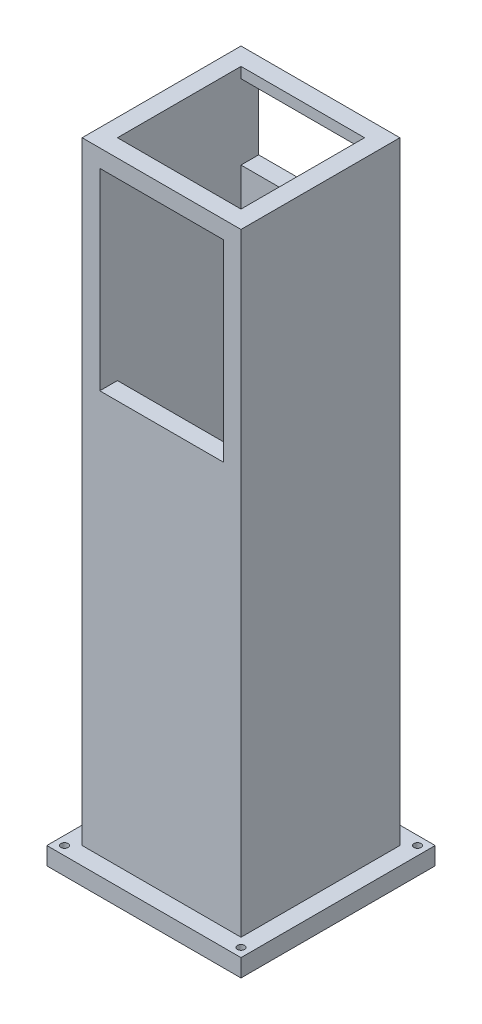
ISO-10303-21;
HEADER;
FILE_DESCRIPTION(('STEP AP214'),'2;1');
FILE_NAME('part.step','',(''),(''),'','','');
FILE_SCHEMA(('AUTOMOTIVE_DESIGN { 1 0 10303 214 1 1 1 1 }'));
ENDSEC;
DATA;
#1=APPLICATION_CONTEXT('core data for automotive mechanical design processes');
#2=APPLICATION_PROTOCOL_DEFINITION('international standard','automotive_design',2000,#1);
#3=PRODUCT_CONTEXT('',#1,'mechanical');
#4=PRODUCT('Part','Part','',(#3));
#5=PRODUCT_RELATED_PRODUCT_CATEGORY('part','',(#4));
#6=PRODUCT_DEFINITION_FORMATION('','',#4);
#7=PRODUCT_DEFINITION_CONTEXT('part definition',#1,'design');
#8=PRODUCT_DEFINITION('design','',#6,#7);
#9=PRODUCT_DEFINITION_SHAPE('','',#8);
#10=(LENGTH_UNIT() NAMED_UNIT(*) SI_UNIT(.MILLI.,.METRE.));
#11=(NAMED_UNIT(*) PLANE_ANGLE_UNIT() SI_UNIT($,.RADIAN.));
#12=(NAMED_UNIT(*) SI_UNIT($,.STERADIAN.) SOLID_ANGLE_UNIT());
#13=UNCERTAINTY_MEASURE_WITH_UNIT(LENGTH_MEASURE(1.E-05),#10,'distance_accuracy_value','');
#14=(GEOMETRIC_REPRESENTATION_CONTEXT(3) GLOBAL_UNCERTAINTY_ASSIGNED_CONTEXT((#13)) GLOBAL_UNIT_ASSIGNED_CONTEXT((#10,
#11,#12)) REPRESENTATION_CONTEXT('',''));
#15=CARTESIAN_POINT('',(0.,0.,0.));
#16=DIRECTION('',(0.,0.,1.));
#17=DIRECTION('',(1.,0.,0.));
#18=AXIS2_PLACEMENT_3D('',#15,#16,#17);
#19=CARTESIAN_POINT('',(-17.5,0.,17.5));
#20=DIRECTION('',(0.,0.,1.));
#21=DIRECTION('',(1.,0.,0.));
#22=AXIS2_PLACEMENT_3D('',#19,#20,#21);
#23=PLANE('',#22);
#24=DIRECTION('',(0.,1.,0.));
#25=VECTOR('',#24,1.);
#26=CARTESIAN_POINT('',(-17.5,0.,17.5));
#27=LINE('',#26,#25);
#28=CARTESIAN_POINT('',(-17.5,268.612120728358,17.5));
#29=VERTEX_POINT('',#28);
#30=CARTESIAN_POINT('',(-17.5,273.612120728358,17.5));
#31=VERTEX_POINT('',#30);
#32=EDGE_CURVE('E332',#29,#31,#27,.T.);
#33=ORIENTED_EDGE('',*,*,#32,.T.);
#34=DIRECTION('',(1.,0.,0.));
#35=VECTOR('',#34,1.);
#36=CARTESIAN_POINT('',(-17.5,273.612120728358,17.5));
#37=LINE('',#36,#35);
#38=CARTESIAN_POINT('',(17.5,273.612120728358,17.5));
#39=VERTEX_POINT('',#38);
#40=EDGE_CURVE('E278',#31,#39,#37,.T.);
#41=ORIENTED_EDGE('',*,*,#40,.T.);
#42=DIRECTION('',(0.,1.,0.));
#43=VECTOR('',#42,1.);
#44=CARTESIAN_POINT('',(17.5,0.,17.5));
#45=LINE('',#44,#43);
#46=CARTESIAN_POINT('',(17.5,268.612120728358,17.5));
#47=VERTEX_POINT('',#46);
#48=EDGE_CURVE('E345',#47,#39,#45,.T.);
#49=ORIENTED_EDGE('',*,*,#48,.F.);
#50=DIRECTION('',(-1.,0.,0.));
#51=VECTOR('',#50,1.);
#52=CARTESIAN_POINT('',(-17.5,268.612120728358,17.5));
#53=LINE('',#52,#51);
#54=EDGE_CURVE('E384',#47,#29,#53,.T.);
#55=ORIENTED_EDGE('',*,*,#54,.T.);
#56=EDGE_LOOP('',(#33,#41,#49,#55));
#57=FACE_BOUND('',#56,.T.);
#58=ADVANCED_FACE('F43',(#57),#23,.F.);
#59=CARTESIAN_POINT('',(-17.5,0.,-17.5));
#60=DIRECTION('',(0.,0.,1.));
#61=DIRECTION('',(1.,0.,0.));
#62=AXIS2_PLACEMENT_3D('',#59,#60,#61);
#63=PLANE('',#62);
#64=DIRECTION('',(1.,0.,0.));
#65=VECTOR('',#64,1.);
#66=CARTESIAN_POINT('',(-17.5,273.612120728358,-17.5));
#67=LINE('',#66,#65);
#68=CARTESIAN_POINT('',(-17.5,273.612120728358,-17.5));
#69=VERTEX_POINT('',#68);
#70=CARTESIAN_POINT('',(17.5,273.612120728358,-17.5));
#71=VERTEX_POINT('',#70);
#72=EDGE_CURVE('E67',#69,#71,#67,.T.);
#73=ORIENTED_EDGE('',*,*,#72,.F.);
#74=DIRECTION('',(0.,1.,0.));
#75=VECTOR('',#74,1.);
#76=CARTESIAN_POINT('',(-17.5,0.,-17.5));
#77=LINE('',#76,#75);
#78=CARTESIAN_POINT('',(-17.5,270.587205010945,-17.5));
#79=VERTEX_POINT('',#78);
#80=EDGE_CURVE('E353',#79,#69,#77,.T.);
#81=ORIENTED_EDGE('',*,*,#80,.F.);
#82=DIRECTION('',(1.,0.,0.));
#83=VECTOR('',#82,1.);
#84=CARTESIAN_POINT('',(-17.5,270.587205010945,-17.5));
#85=LINE('',#84,#83);
#86=CARTESIAN_POINT('',(17.5,270.587205010945,-17.5));
#87=VERTEX_POINT('',#86);
#88=EDGE_CURVE('E372',#79,#87,#85,.T.);
#89=ORIENTED_EDGE('',*,*,#88,.T.);
#90=DIRECTION('',(0.,1.,0.));
#91=VECTOR('',#90,1.);
#92=CARTESIAN_POINT('',(17.5,0.,-17.5));
#93=LINE('',#92,#91);
#94=EDGE_CURVE('E349',#87,#71,#93,.T.);
#95=ORIENTED_EDGE('',*,*,#94,.T.);
#96=EDGE_LOOP('',(#73,#81,#89,#95));
#97=FACE_BOUND('',#96,.T.);
#98=ADVANCED_FACE('F398',(#97),#63,.T.);
#99=CARTESIAN_POINT('',(22.5,300.,22.5));
#100=DIRECTION('',(-1.,0.,0.));
#101=DIRECTION('',(0.,0.,1.));
#102=AXIS2_PLACEMENT_3D('',#99,#100,#101);
#103=PLANE('',#102);
#104=DIRECTION('',(0.,-1.,0.));
#105=VECTOR('',#104,1.);
#106=CARTESIAN_POINT('',(22.5,300.,22.5));
#107=LINE('',#106,#105);
#108=CARTESIAN_POINT('',(22.5,273.612120728358,22.5));
#109=VERTEX_POINT('',#108);
#110=CARTESIAN_POINT('',(22.5,100.,22.5));
#111=VERTEX_POINT('',#110);
#112=EDGE_CURVE('E357',#109,#111,#107,.T.);
#113=ORIENTED_EDGE('',*,*,#112,.T.);
#114=DIRECTION('',(0.,0.,1.));
#115=VECTOR('',#114,1.);
#116=CARTESIAN_POINT('',(22.5,100.,22.5));
#117=LINE('',#116,#115);
#118=CARTESIAN_POINT('',(22.5,100.,-22.5));
#119=VERTEX_POINT('',#118);
#120=EDGE_CURVE('E232',#119,#111,#117,.T.);
#121=ORIENTED_EDGE('',*,*,#120,.F.);
#122=DIRECTION('',(0.,-1.,0.));
#123=VECTOR('',#122,1.);
#124=CARTESIAN_POINT('',(22.5,300.,-22.5));
#125=LINE('',#124,#123);
#126=CARTESIAN_POINT('',(22.5,273.612120728358,-22.5));
#127=VERTEX_POINT('',#126);
#128=EDGE_CURVE('E368',#127,#119,#125,.T.);
#129=ORIENTED_EDGE('',*,*,#128,.F.);
#130=DIRECTION('',(0.,0.,1.));
#131=VECTOR('',#130,1.);
#132=CARTESIAN_POINT('',(22.5,273.612120728358,-22.5));
#133=LINE('',#132,#131);
#134=EDGE_CURVE('E270',#127,#109,#133,.T.);
#135=ORIENTED_EDGE('',*,*,#134,.T.);
#136=EDGE_LOOP('',(#113,#121,#129,#135));
#137=FACE_BOUND('',#136,.T.);
#138=ADVANCED_FACE('F45',(#137),#103,.F.);
#139=CARTESIAN_POINT('',(-22.5,300.,-22.5));
#140=DIRECTION('',(0.,0.,1.));
#141=DIRECTION('',(1.,0.,0.));
#142=AXIS2_PLACEMENT_3D('',#139,#140,#141);
#143=PLANE('',#142);
#144=DIRECTION('',(0.,1.,0.));
#145=VECTOR('',#144,1.);
#146=CARTESIAN_POINT('',(-17.5,249.412794989055,-22.5));
#147=LINE('',#146,#145);
#148=CARTESIAN_POINT('',(-17.5,249.412794989055,-22.5));
#149=VERTEX_POINT('',#148);
#150=CARTESIAN_POINT('',(-17.5,270.587205010945,-22.5));
#151=VERTEX_POINT('',#150);
#152=EDGE_CURVE('E316',#149,#151,#147,.T.);
#153=ORIENTED_EDGE('',*,*,#152,.F.);
#154=DIRECTION('',(-1.,0.,0.));
#155=VECTOR('',#154,1.);
#156=CARTESIAN_POINT('',(17.5,249.412794989055,-22.5));
#157=LINE('',#156,#155);
#158=CARTESIAN_POINT('',(17.5,249.412794989055,-22.5));
#159=VERTEX_POINT('',#158);
#160=EDGE_CURVE('E304',#159,#149,#157,.T.);
#161=ORIENTED_EDGE('',*,*,#160,.F.);
#162=DIRECTION('',(0.,1.,0.));
#163=VECTOR('',#162,1.);
#164=CARTESIAN_POINT('',(17.5,249.412794989055,-22.5));
#165=LINE('',#164,#163);
#166=CARTESIAN_POINT('',(17.5,270.587205010945,-22.5));
#167=VERTEX_POINT('',#166);
#168=EDGE_CURVE('E324',#159,#167,#165,.T.);
#169=ORIENTED_EDGE('',*,*,#168,.T.);
#170=DIRECTION('',(-1.,0.,0.));
#171=VECTOR('',#170,1.);
#172=CARTESIAN_POINT('',(17.5,270.587205010945,-22.5));
#173=LINE('',#172,#171);
#174=EDGE_CURVE('E320',#167,#151,#173,.T.);
#175=ORIENTED_EDGE('',*,*,#174,.T.);
#176=EDGE_LOOP('',(#153,#161,#169,#175));
#177=FACE_BOUND('',#176,.T.);
#178=ORIENTED_EDGE('',*,*,#128,.T.);
#179=DIRECTION('',(1.,0.,0.));
#180=VECTOR('',#179,1.);
#181=CARTESIAN_POINT('',(-22.5,100.,-22.5));
#182=LINE('',#181,#180);
#183=CARTESIAN_POINT('',(-22.5,100.,-22.5));
#184=VERTEX_POINT('',#183);
#185=EDGE_CURVE('E244',#184,#119,#182,.T.);
#186=ORIENTED_EDGE('',*,*,#185,.F.);
#187=DIRECTION('',(0.,-1.,0.));
#188=VECTOR('',#187,1.);
#189=CARTESIAN_POINT('',(-22.5,300.,-22.5));
#190=LINE('',#189,#188);
#191=CARTESIAN_POINT('',(-22.5,273.612120728358,-22.5));
#192=VERTEX_POINT('',#191);
#193=EDGE_CURVE('E364',#192,#184,#190,.T.);
#194=ORIENTED_EDGE('',*,*,#193,.F.);
#195=DIRECTION('',(1.,0.,0.));
#196=VECTOR('',#195,1.);
#197=CARTESIAN_POINT('',(-22.5,273.612120728358,-22.5));
#198=LINE('',#197,#196);
#199=EDGE_CURVE('E264',#192,#127,#198,.T.);
#200=ORIENTED_EDGE('',*,*,#199,.T.);
#201=EDGE_LOOP('',(#178,#186,#194,#200));
#202=FACE_BOUND('',#201,.T.);
#203=ADVANCED_FACE('F508',(#177,#202),#143,.F.);
#204=CARTESIAN_POINT('',(-22.5,300.,22.5));
#205=DIRECTION('',(1.,0.,0.));
#206=DIRECTION('',(0.,0.,-1.));
#207=AXIS2_PLACEMENT_3D('',#204,#205,#206);
#208=PLANE('',#207);
#209=ORIENTED_EDGE('',*,*,#193,.T.);
#210=DIRECTION('',(0.,0.,1.));
#211=VECTOR('',#210,1.);
#212=CARTESIAN_POINT('',(-22.5,100.,22.5));
#213=LINE('',#212,#211);
#214=CARTESIAN_POINT('',(-22.5,100.,22.5));
#215=VERTEX_POINT('',#214);
#216=EDGE_CURVE('E241',#184,#215,#213,.T.);
#217=ORIENTED_EDGE('',*,*,#216,.T.);
#218=DIRECTION('',(0.,-1.,0.));
#219=VECTOR('',#218,1.);
#220=CARTESIAN_POINT('',(-22.5,300.,22.5));
#221=LINE('',#220,#219);
#222=CARTESIAN_POINT('',(-22.5,273.612120728358,22.5));
#223=VERTEX_POINT('',#222);
#224=EDGE_CURVE('E360',#223,#215,#221,.T.);
#225=ORIENTED_EDGE('',*,*,#224,.F.);
#226=DIRECTION('',(0.,0.,1.));
#227=VECTOR('',#226,1.);
#228=CARTESIAN_POINT('',(-22.5,273.612120728358,-22.5));
#229=LINE('',#228,#227);
#230=EDGE_CURVE('E59',#192,#223,#229,.T.);
#231=ORIENTED_EDGE('',*,*,#230,.F.);
#232=EDGE_LOOP('',(#209,#217,#225,#231));
#233=FACE_BOUND('',#232,.T.);
#234=ADVANCED_FACE('F756',(#233),#208,.F.);
#235=CARTESIAN_POINT('',(-22.5,300.,22.5));
#236=DIRECTION('',(0.,0.,-1.));
#237=DIRECTION('',(-1.,0.,0.));
#238=AXIS2_PLACEMENT_3D('',#235,#236,#237);
#239=PLANE('',#238);
#240=DIRECTION('',(1.,0.,0.));
#241=VECTOR('',#240,1.);
#242=CARTESIAN_POINT('',(-17.5,214.038722741917,22.5));
#243=LINE('',#242,#241);
#244=CARTESIAN_POINT('',(-17.5,214.038722741917,22.5));
#245=VERTEX_POINT('',#244);
#246=CARTESIAN_POINT('',(17.5,214.038722741917,22.5));
#247=VERTEX_POINT('',#246);
#248=EDGE_CURVE('E288',#245,#247,#243,.T.);
#249=ORIENTED_EDGE('',*,*,#248,.F.);
#250=DIRECTION('',(0.,-1.,0.));
#251=VECTOR('',#250,1.);
#252=CARTESIAN_POINT('',(-17.5,268.612120728358,22.5));
#253=LINE('',#252,#251);
#254=CARTESIAN_POINT('',(-17.5,268.612120728358,22.5));
#255=VERTEX_POINT('',#254);
#256=EDGE_CURVE('E285',#255,#245,#253,.T.);
#257=ORIENTED_EDGE('',*,*,#256,.F.);
#258=DIRECTION('',(-1.,0.,0.));
#259=VECTOR('',#258,1.);
#260=CARTESIAN_POINT('',(-17.5,268.612120728358,22.5));
#261=LINE('',#260,#259);
#262=CARTESIAN_POINT('',(17.5,268.612120728358,22.5));
#263=VERTEX_POINT('',#262);
#264=EDGE_CURVE('E296',#263,#255,#261,.T.);
#265=ORIENTED_EDGE('',*,*,#264,.F.);
#266=DIRECTION('',(0.,1.,0.));
#267=VECTOR('',#266,1.);
#268=CARTESIAN_POINT('',(17.5,268.612120728358,22.5));
#269=LINE('',#268,#267);
#270=EDGE_CURVE('E292',#247,#263,#269,.T.);
#271=ORIENTED_EDGE('',*,*,#270,.F.);
#272=EDGE_LOOP('',(#249,#257,#265,#271));
#273=FACE_BOUND('',#272,.T.);
#274=ORIENTED_EDGE('',*,*,#224,.T.);
#275=DIRECTION('',(1.,0.,0.));
#276=VECTOR('',#275,1.);
#277=CARTESIAN_POINT('',(-22.5,100.,22.5));
#278=LINE('',#277,#276);
#279=EDGE_CURVE('E245',#215,#111,#278,.T.);
#280=ORIENTED_EDGE('',*,*,#279,.T.);
#281=ORIENTED_EDGE('',*,*,#112,.F.);
#282=DIRECTION('',(1.,0.,0.));
#283=VECTOR('',#282,1.);
#284=CARTESIAN_POINT('',(-22.5,273.612120728358,22.5));
#285=LINE('',#284,#283);
#286=EDGE_CURVE('E263',#223,#109,#285,.T.);
#287=ORIENTED_EDGE('',*,*,#286,.F.);
#288=EDGE_LOOP('',(#274,#280,#281,#287));
#289=FACE_BOUND('',#288,.T.);
#290=ADVANCED_FACE('F491',(#273,#289),#239,.F.);
#291=CARTESIAN_POINT('',(-17.5,0.,17.5));
#292=DIRECTION('',(1.,0.,0.));
#293=DIRECTION('',(0.,0.,-1.));
#294=AXIS2_PLACEMENT_3D('',#291,#292,#293);
#295=PLANE('',#294);
#296=DIRECTION('',(0.,0.,1.));
#297=VECTOR('',#296,1.);
#298=CARTESIAN_POINT('',(-17.5,100.,17.5));
#299=LINE('',#298,#297);
#300=CARTESIAN_POINT('',(-17.5,100.,-17.5));
#301=VERTEX_POINT('',#300);
#302=CARTESIAN_POINT('',(-17.5,100.,17.5));
#303=VERTEX_POINT('',#302);
#304=EDGE_CURVE('E256',#301,#303,#299,.T.);
#305=ORIENTED_EDGE('',*,*,#304,.F.);
#306=CARTESIAN_POINT('',(-17.5,249.412794989055,-17.5));
#307=VERTEX_POINT('',#306);
#308=EDGE_CURVE('E354',#301,#307,#77,.T.);
#309=ORIENTED_EDGE('',*,*,#308,.T.);
#310=DIRECTION('',(0.,0.,-1.));
#311=VECTOR('',#310,1.);
#312=CARTESIAN_POINT('',(-17.5,249.412794989055,-12.5));
#313=LINE('',#312,#311);
#314=EDGE_CURVE('E328',#307,#149,#313,.T.);
#315=ORIENTED_EDGE('',*,*,#314,.T.);
#316=ORIENTED_EDGE('',*,*,#152,.T.);
#317=DIRECTION('',(0.,0.,-1.));
#318=VECTOR('',#317,1.);
#319=CARTESIAN_POINT('',(-17.5,270.587205010945,-12.5));
#320=LINE('',#319,#318);
#321=EDGE_CURVE('E336',#79,#151,#320,.T.);
#322=ORIENTED_EDGE('',*,*,#321,.F.);
#323=ORIENTED_EDGE('',*,*,#80,.T.);
#324=DIRECTION('',(0.,0.,-1.));
#325=VECTOR('',#324,1.);
#326=CARTESIAN_POINT('',(-17.5,273.612120728358,17.5));
#327=LINE('',#326,#325);
#328=EDGE_CURVE('E282',#31,#69,#327,.T.);
#329=ORIENTED_EDGE('',*,*,#328,.F.);
#330=ORIENTED_EDGE('',*,*,#32,.F.);
#331=DIRECTION('',(0.,0.,1.));
#332=VECTOR('',#331,1.);
#333=CARTESIAN_POINT('',(-17.5,268.612120728358,12.5));
#334=LINE('',#333,#332);
#335=EDGE_CURVE('E301',#29,#255,#334,.T.);
#336=ORIENTED_EDGE('',*,*,#335,.T.);
#337=ORIENTED_EDGE('',*,*,#256,.T.);
#338=DIRECTION('',(0.,0.,1.));
#339=VECTOR('',#338,1.);
#340=CARTESIAN_POINT('',(-17.5,214.038722741917,12.5));
#341=LINE('',#340,#339);
#342=CARTESIAN_POINT('',(-17.5,214.038722741917,17.5));
#343=VERTEX_POINT('',#342);
#344=EDGE_CURVE('E300',#343,#245,#341,.T.);
#345=ORIENTED_EDGE('',*,*,#344,.F.);
#346=EDGE_CURVE('E342',#303,#343,#27,.T.);
#347=ORIENTED_EDGE('',*,*,#346,.F.);
#348=EDGE_LOOP('',(#305,#309,#315,#316,#322,#323,#329,#330,#336,#337,#345,#347));
#349=FACE_BOUND('',#348,.T.);
#350=ADVANCED_FACE('F478',(#349),#295,.T.);
#351=CARTESIAN_POINT('',(17.5,0.,17.5));
#352=DIRECTION('',(1.,0.,0.));
#353=DIRECTION('',(0.,0.,-1.));
#354=AXIS2_PLACEMENT_3D('',#351,#352,#353);
#355=PLANE('',#354);
#356=CARTESIAN_POINT('',(17.5,100.,-17.5));
#357=VERTEX_POINT('',#356);
#358=CARTESIAN_POINT('',(17.5,249.412794989055,-17.5));
#359=VERTEX_POINT('',#358);
#360=EDGE_CURVE('E350',#357,#359,#93,.T.);
#361=ORIENTED_EDGE('',*,*,#360,.F.);
#362=DIRECTION('',(0.,0.,1.));
#363=VECTOR('',#362,1.);
#364=CARTESIAN_POINT('',(17.5,100.,17.5));
#365=LINE('',#364,#363);
#366=CARTESIAN_POINT('',(17.5,100.,17.5));
#367=VERTEX_POINT('',#366);
#368=EDGE_CURVE('E249',#357,#367,#365,.T.);
#369=ORIENTED_EDGE('',*,*,#368,.T.);
#370=CARTESIAN_POINT('',(17.5,214.038722741917,17.5));
#371=VERTEX_POINT('',#370);
#372=EDGE_CURVE('E346',#367,#371,#45,.T.);
#373=ORIENTED_EDGE('',*,*,#372,.T.);
#374=DIRECTION('',(0.,0.,1.));
#375=VECTOR('',#374,1.);
#376=CARTESIAN_POINT('',(17.5,214.038722741917,12.5));
#377=LINE('',#376,#375);
#378=EDGE_CURVE('E308',#371,#247,#377,.T.);
#379=ORIENTED_EDGE('',*,*,#378,.T.);
#380=ORIENTED_EDGE('',*,*,#270,.T.);
#381=DIRECTION('',(0.,0.,1.));
#382=VECTOR('',#381,1.);
#383=CARTESIAN_POINT('',(17.5,268.612120728358,12.5));
#384=LINE('',#383,#382);
#385=EDGE_CURVE('E305',#47,#263,#384,.T.);
#386=ORIENTED_EDGE('',*,*,#385,.F.);
#387=ORIENTED_EDGE('',*,*,#48,.T.);
#388=DIRECTION('',(0.,0.,-1.));
#389=VECTOR('',#388,1.);
#390=CARTESIAN_POINT('',(17.5,273.612120728358,17.5));
#391=LINE('',#390,#389);
#392=EDGE_CURVE('E52',#39,#71,#391,.T.);
#393=ORIENTED_EDGE('',*,*,#392,.T.);
#394=ORIENTED_EDGE('',*,*,#94,.F.);
#395=DIRECTION('',(0.,0.,-1.));
#396=VECTOR('',#395,1.);
#397=CARTESIAN_POINT('',(17.5,270.587205010945,-12.5));
#398=LINE('',#397,#396);
#399=EDGE_CURVE('E333',#87,#167,#398,.T.);
#400=ORIENTED_EDGE('',*,*,#399,.T.);
#401=ORIENTED_EDGE('',*,*,#168,.F.);
#402=DIRECTION('',(0.,0.,-1.));
#403=VECTOR('',#402,1.);
#404=CARTESIAN_POINT('',(17.5,249.412794989055,-12.5));
#405=LINE('',#404,#403);
#406=EDGE_CURVE('E329',#359,#159,#405,.T.);
#407=ORIENTED_EDGE('',*,*,#406,.F.);
#408=EDGE_LOOP('',(#361,#369,#373,#379,#380,#386,#387,#393,#394,#400,#401,#407));
#409=FACE_BOUND('',#408,.T.);
#410=ADVANCED_FACE('F394',(#409),#355,.F.);
#411=ORIENTED_EDGE('',*,*,#372,.F.);
#412=DIRECTION('',(-1.,0.,0.));
#413=VECTOR('',#412,1.);
#414=CARTESIAN_POINT('',(-17.5,100.,17.5));
#415=LINE('',#414,#413);
#416=EDGE_CURVE('E259',#367,#303,#415,.T.);
#417=ORIENTED_EDGE('',*,*,#416,.T.);
#418=ORIENTED_EDGE('',*,*,#346,.T.);
#419=DIRECTION('',(1.,0.,0.));
#420=VECTOR('',#419,1.);
#421=CARTESIAN_POINT('',(-17.5,214.038722741917,17.5));
#422=LINE('',#421,#420);
#423=EDGE_CURVE('E380',#343,#371,#422,.T.);
#424=ORIENTED_EDGE('',*,*,#423,.T.);
#425=EDGE_LOOP('',(#411,#417,#418,#424));
#426=FACE_BOUND('',#425,.T.);
#427=ADVANCED_FACE('F462',(#426),#23,.F.);
#428=DIRECTION('',(-1.,0.,0.));
#429=VECTOR('',#428,1.);
#430=CARTESIAN_POINT('',(-17.5,100.,-17.5));
#431=LINE('',#430,#429);
#432=EDGE_CURVE('E11',#357,#301,#431,.T.);
#433=ORIENTED_EDGE('',*,*,#432,.F.);
#434=ORIENTED_EDGE('',*,*,#360,.T.);
#435=DIRECTION('',(1.,0.,0.));
#436=VECTOR('',#435,1.);
#437=CARTESIAN_POINT('',(-17.5,249.412794989055,-17.5));
#438=LINE('',#437,#436);
#439=EDGE_CURVE('E376',#307,#359,#438,.T.);
#440=ORIENTED_EDGE('',*,*,#439,.F.);
#441=ORIENTED_EDGE('',*,*,#308,.F.);
#442=EDGE_LOOP('',(#433,#434,#440,#441));
#443=FACE_BOUND('',#442,.T.);
#444=ADVANCED_FACE('F467',(#443),#63,.T.);
#445=CARTESIAN_POINT('',(17.5,249.412794989055,-12.5));
#446=DIRECTION('',(0.,-1.,0.));
#447=DIRECTION('',(0.,0.,-1.));
#448=AXIS2_PLACEMENT_3D('',#445,#446,#447);
#449=PLANE('',#448);
#450=ORIENTED_EDGE('',*,*,#439,.T.);
#451=ORIENTED_EDGE('',*,*,#406,.T.);
#452=ORIENTED_EDGE('',*,*,#160,.T.);
#453=ORIENTED_EDGE('',*,*,#314,.F.);
#454=EDGE_LOOP('',(#450,#451,#452,#453));
#455=FACE_BOUND('',#454,.T.);
#456=ADVANCED_FACE('F476',(#455),#449,.F.);
#457=CARTESIAN_POINT('',(17.5,270.587205010945,-12.5));
#458=DIRECTION('',(0.,-1.,0.));
#459=DIRECTION('',(0.,0.,-1.));
#460=AXIS2_PLACEMENT_3D('',#457,#458,#459);
#461=PLANE('',#460);
#462=ORIENTED_EDGE('',*,*,#321,.T.);
#463=ORIENTED_EDGE('',*,*,#174,.F.);
#464=ORIENTED_EDGE('',*,*,#399,.F.);
#465=ORIENTED_EDGE('',*,*,#88,.F.);
#466=EDGE_LOOP('',(#462,#463,#464,#465));
#467=FACE_BOUND('',#466,.T.);
#468=ADVANCED_FACE('F503',(#467),#461,.T.);
#469=CARTESIAN_POINT('',(-17.5,268.612120728358,12.5));
#470=DIRECTION('',(0.,1.,0.));
#471=DIRECTION('',(0.,0.,1.));
#472=AXIS2_PLACEMENT_3D('',#469,#470,#471);
#473=PLANE('',#472);
#474=ORIENTED_EDGE('',*,*,#385,.T.);
#475=ORIENTED_EDGE('',*,*,#264,.T.);
#476=ORIENTED_EDGE('',*,*,#335,.F.);
#477=ORIENTED_EDGE('',*,*,#54,.F.);
#478=EDGE_LOOP('',(#474,#475,#476,#477));
#479=FACE_BOUND('',#478,.T.);
#480=ADVANCED_FACE('F539',(#479),#473,.F.);
#481=CARTESIAN_POINT('',(-17.5,214.038722741917,12.5));
#482=DIRECTION('',(0.,-1.,0.));
#483=DIRECTION('',(0.,0.,-1.));
#484=AXIS2_PLACEMENT_3D('',#481,#482,#483);
#485=PLANE('',#484);
#486=ORIENTED_EDGE('',*,*,#344,.T.);
#487=ORIENTED_EDGE('',*,*,#248,.T.);
#488=ORIENTED_EDGE('',*,*,#378,.F.);
#489=ORIENTED_EDGE('',*,*,#423,.F.);
#490=EDGE_LOOP('',(#486,#487,#488,#489));
#491=FACE_BOUND('',#490,.T.);
#492=ADVANCED_FACE('F484',(#491),#485,.F.);
#493=CARTESIAN_POINT('',(-22.5,273.612120728358,-22.5));
#494=DIRECTION('',(0.,-1.,0.));
#495=DIRECTION('',(0.,0.,-1.));
#496=AXIS2_PLACEMENT_3D('',#493,#494,#495);
#497=PLANE('',#496);
#498=ORIENTED_EDGE('',*,*,#328,.T.);
#499=ORIENTED_EDGE('',*,*,#72,.T.);
#500=ORIENTED_EDGE('',*,*,#392,.F.);
#501=ORIENTED_EDGE('',*,*,#40,.F.);
#502=EDGE_LOOP('',(#498,#499,#500,#501));
#503=FACE_BOUND('',#502,.T.);
#504=ORIENTED_EDGE('',*,*,#286,.T.);
#505=ORIENTED_EDGE('',*,*,#134,.F.);
#506=ORIENTED_EDGE('',*,*,#199,.F.);
#507=ORIENTED_EDGE('',*,*,#230,.T.);
#508=EDGE_LOOP('',(#504,#505,#506,#507));
#509=FACE_BOUND('',#508,.T.);
#510=ADVANCED_FACE('F497',(#503,#509),#497,.F.);
#511=CARTESIAN_POINT('',(0.,100.,0.));
#512=DIRECTION('',(0.,1.,0.));
#513=DIRECTION('',(0.,0.,1.));
#514=AXIS2_PLACEMENT_3D('',#511,#512,#513);
#515=PLANE('',#514);
#516=ORIENTED_EDGE('',*,*,#368,.F.);
#517=ORIENTED_EDGE('',*,*,#432,.T.);
#518=ORIENTED_EDGE('',*,*,#304,.T.);
#519=ORIENTED_EDGE('',*,*,#416,.F.);
#520=EDGE_LOOP('',(#516,#517,#518,#519));
#521=FACE_BOUND('',#520,.T.);
#522=ADVANCED_FACE('F516',(#521),#515,.T.);
#523=CARTESIAN_POINT('',(25.,100.,-25.));
#524=DIRECTION('',(0.,1.,0.));
#525=DIRECTION('',(0.,0.,1.));
#526=AXIS2_PLACEMENT_3D('',#523,#524,#525);
#527=CIRCLE('',#526,1.);
#528=CARTESIAN_POINT('',(25.,100.,-24.));
#529=VERTEX_POINT('',#528);
#530=EDGE_CURVE('E215',#529,#529,#527,.T.);
#531=ORIENTED_EDGE('',*,*,#530,.F.);
#532=EDGE_LOOP('',(#531));
#533=FACE_BOUND('',#532,.T.);
#534=CARTESIAN_POINT('',(-25.,100.,-25.));
#535=DIRECTION('',(0.,1.,0.));
#536=DIRECTION('',(0.,0.,1.));
#537=AXIS2_PLACEMENT_3D('',#534,#535,#536);
#538=CIRCLE('',#537,1.);
#539=CARTESIAN_POINT('',(-25.,100.,-24.));
#540=VERTEX_POINT('',#539);
#541=EDGE_CURVE('E411',#540,#540,#538,.T.);
#542=ORIENTED_EDGE('',*,*,#541,.F.);
#543=EDGE_LOOP('',(#542));
#544=FACE_BOUND('',#543,.T.);
#545=CARTESIAN_POINT('',(-25.,100.,25.));
#546=DIRECTION('',(0.,1.,0.));
#547=DIRECTION('',(0.,0.,1.));
#548=AXIS2_PLACEMENT_3D('',#545,#546,#547);
#549=CIRCLE('',#548,1.);
#550=CARTESIAN_POINT('',(-25.,100.,26.));
#551=VERTEX_POINT('',#550);
#552=EDGE_CURVE('E418',#551,#551,#549,.T.);
#553=ORIENTED_EDGE('',*,*,#552,.F.);
#554=EDGE_LOOP('',(#553));
#555=FACE_BOUND('',#554,.T.);
#556=CARTESIAN_POINT('',(25.,100.,25.));
#557=DIRECTION('',(0.,1.,0.));
#558=DIRECTION('',(0.,0.,1.));
#559=AXIS2_PLACEMENT_3D('',#556,#557,#558);
#560=CIRCLE('',#559,1.);
#561=CARTESIAN_POINT('',(25.,100.,26.));
#562=VERTEX_POINT('',#561);
#563=EDGE_CURVE('E406',#562,#562,#560,.T.);
#564=ORIENTED_EDGE('',*,*,#563,.F.);
#565=EDGE_LOOP('',(#564));
#566=FACE_BOUND('',#565,.T.);
#567=DIRECTION('',(0.,0.,1.));
#568=VECTOR('',#567,1.);
#569=CARTESIAN_POINT('',(-27.5,100.,-27.5));
#570=LINE('',#569,#568);
#571=CARTESIAN_POINT('',(-27.5,100.,-27.5));
#572=VERTEX_POINT('',#571);
#573=CARTESIAN_POINT('',(-27.5,100.,27.5));
#574=VERTEX_POINT('',#573);
#575=EDGE_CURVE('E222',#572,#574,#570,.T.);
#576=ORIENTED_EDGE('',*,*,#575,.T.);
#577=DIRECTION('',(1.,0.,0.));
#578=VECTOR('',#577,1.);
#579=CARTESIAN_POINT('',(-27.5,100.,27.5));
#580=LINE('',#579,#578);
#581=CARTESIAN_POINT('',(27.5,100.,27.5));
#582=VERTEX_POINT('',#581);
#583=EDGE_CURVE('E185',#574,#582,#580,.T.);
#584=ORIENTED_EDGE('',*,*,#583,.T.);
#585=DIRECTION('',(0.,0.,1.));
#586=VECTOR('',#585,1.);
#587=CARTESIAN_POINT('',(27.5,100.,-27.5));
#588=LINE('',#587,#586);
#589=CARTESIAN_POINT('',(27.5,100.,-27.5));
#590=VERTEX_POINT('',#589);
#591=EDGE_CURVE('E212',#590,#582,#588,.T.);
#592=ORIENTED_EDGE('',*,*,#591,.F.);
#593=DIRECTION('',(1.,0.,0.));
#594=VECTOR('',#593,1.);
#595=CARTESIAN_POINT('',(-27.5,100.,-27.5));
#596=LINE('',#595,#594);
#597=EDGE_CURVE('E207',#572,#590,#596,.T.);
#598=ORIENTED_EDGE('',*,*,#597,.F.);
#599=EDGE_LOOP('',(#576,#584,#592,#598));
#600=FACE_BOUND('',#599,.T.);
#601=ORIENTED_EDGE('',*,*,#279,.F.);
#602=ORIENTED_EDGE('',*,*,#216,.F.);
#603=ORIENTED_EDGE('',*,*,#185,.T.);
#604=ORIENTED_EDGE('',*,*,#120,.T.);
#605=EDGE_LOOP('',(#601,#602,#603,#604));
#606=FACE_BOUND('',#605,.T.);
#607=ADVANCED_FACE('F518',(#533,#544,#555,#566,#600,#606),#515,.T.);
#608=CARTESIAN_POINT('',(-27.5,95.,-27.5));
#609=DIRECTION('',(-1.,0.,0.));
#610=DIRECTION('',(0.,0.,1.));
#611=AXIS2_PLACEMENT_3D('',#608,#609,#610);
#612=PLANE('',#611);
#613=ORIENTED_EDGE('',*,*,#575,.F.);
#614=DIRECTION('',(0.,1.,0.));
#615=VECTOR('',#614,1.);
#616=CARTESIAN_POINT('',(-27.5,95.,-27.5));
#617=LINE('',#616,#615);
#618=CARTESIAN_POINT('',(-27.5,95.,-27.5));
#619=VERTEX_POINT('',#618);
#620=EDGE_CURVE('E204',#619,#572,#617,.T.);
#621=ORIENTED_EDGE('',*,*,#620,.F.);
#622=DIRECTION('',(0.,0.,1.));
#623=VECTOR('',#622,1.);
#624=CARTESIAN_POINT('',(-27.5,95.,-27.5));
#625=LINE('',#624,#623);
#626=CARTESIAN_POINT('',(-27.5,95.,27.5));
#627=VERTEX_POINT('',#626);
#628=EDGE_CURVE('E197',#619,#627,#625,.T.);
#629=ORIENTED_EDGE('',*,*,#628,.T.);
#630=DIRECTION('',(0.,1.,0.));
#631=VECTOR('',#630,1.);
#632=CARTESIAN_POINT('',(-27.5,95.,27.5));
#633=LINE('',#632,#631);
#634=EDGE_CURVE('E180',#627,#574,#633,.T.);
#635=ORIENTED_EDGE('',*,*,#634,.T.);
#636=EDGE_LOOP('',(#613,#621,#629,#635));
#637=FACE_BOUND('',#636,.T.);
#638=ADVANCED_FACE('F203',(#637),#612,.T.);
#639=CARTESIAN_POINT('',(-27.5,95.,-27.5));
#640=DIRECTION('',(0.,0.,1.));
#641=DIRECTION('',(1.,0.,0.));
#642=AXIS2_PLACEMENT_3D('',#639,#640,#641);
#643=PLANE('',#642);
#644=ORIENTED_EDGE('',*,*,#597,.T.);
#645=DIRECTION('',(0.,1.,0.));
#646=VECTOR('',#645,1.);
#647=CARTESIAN_POINT('',(27.5,95.,-27.5));
#648=LINE('',#647,#646);
#649=CARTESIAN_POINT('',(27.5,95.,-27.5));
#650=VERTEX_POINT('',#649);
#651=EDGE_CURVE('E233',#650,#590,#648,.T.);
#652=ORIENTED_EDGE('',*,*,#651,.F.);
#653=DIRECTION('',(1.,0.,0.));
#654=VECTOR('',#653,1.);
#655=CARTESIAN_POINT('',(-27.5,95.,-27.5));
#656=LINE('',#655,#654);
#657=EDGE_CURVE('E192',#619,#650,#656,.T.);
#658=ORIENTED_EDGE('',*,*,#657,.F.);
#659=ORIENTED_EDGE('',*,*,#620,.T.);
#660=EDGE_LOOP('',(#644,#652,#658,#659));
#661=FACE_BOUND('',#660,.T.);
#662=ADVANCED_FACE('F527',(#661),#643,.F.);
#663=CARTESIAN_POINT('',(27.5,95.,-27.5));
#664=DIRECTION('',(-1.,0.,0.));
#665=DIRECTION('',(0.,0.,1.));
#666=AXIS2_PLACEMENT_3D('',#663,#664,#665);
#667=PLANE('',#666);
#668=ORIENTED_EDGE('',*,*,#591,.T.);
#669=DIRECTION('',(0.,1.,0.));
#670=VECTOR('',#669,1.);
#671=CARTESIAN_POINT('',(27.5,95.,27.5));
#672=LINE('',#671,#670);
#673=CARTESIAN_POINT('',(27.5,95.,27.5));
#674=VERTEX_POINT('',#673);
#675=EDGE_CURVE('E191',#674,#582,#672,.T.);
#676=ORIENTED_EDGE('',*,*,#675,.F.);
#677=DIRECTION('',(0.,0.,1.));
#678=VECTOR('',#677,1.);
#679=CARTESIAN_POINT('',(27.5,95.,-27.5));
#680=LINE('',#679,#678);
#681=EDGE_CURVE('E199',#650,#674,#680,.T.);
#682=ORIENTED_EDGE('',*,*,#681,.F.);
#683=ORIENTED_EDGE('',*,*,#651,.T.);
#684=EDGE_LOOP('',(#668,#676,#682,#683));
#685=FACE_BOUND('',#684,.T.);
#686=ADVANCED_FACE('F530',(#685),#667,.F.);
#687=CARTESIAN_POINT('',(-27.5,95.,27.5));
#688=DIRECTION('',(0.,0.,1.));
#689=DIRECTION('',(1.,0.,0.));
#690=AXIS2_PLACEMENT_3D('',#687,#688,#689);
#691=PLANE('',#690);
#692=ORIENTED_EDGE('',*,*,#583,.F.);
#693=ORIENTED_EDGE('',*,*,#634,.F.);
#694=DIRECTION('',(1.,0.,0.));
#695=VECTOR('',#694,1.);
#696=CARTESIAN_POINT('',(-27.5,95.,27.5));
#697=LINE('',#696,#695);
#698=EDGE_CURVE('E183',#627,#674,#697,.T.);
#699=ORIENTED_EDGE('',*,*,#698,.T.);
#700=ORIENTED_EDGE('',*,*,#675,.T.);
#701=EDGE_LOOP('',(#692,#693,#699,#700));
#702=FACE_BOUND('',#701,.T.);
#703=ADVANCED_FACE('F182',(#702),#691,.T.);
#704=CARTESIAN_POINT('',(0.,95.,0.));
#705=DIRECTION('',(0.,1.,0.));
#706=DIRECTION('',(0.,0.,1.));
#707=AXIS2_PLACEMENT_3D('',#704,#705,#706);
#708=PLANE('',#707);
#709=CARTESIAN_POINT('',(25.,95.,-25.));
#710=DIRECTION('',(0.,-1.,0.));
#711=DIRECTION('',(0.,0.,-1.));
#712=AXIS2_PLACEMENT_3D('',#709,#710,#711);
#713=CIRCLE('',#712,1.);
#714=CARTESIAN_POINT('',(25.,95.,-26.));
#715=VERTEX_POINT('',#714);
#716=EDGE_CURVE('E423',#715,#715,#713,.T.);
#717=ORIENTED_EDGE('',*,*,#716,.F.);
#718=EDGE_LOOP('',(#717));
#719=FACE_BOUND('',#718,.T.);
#720=CARTESIAN_POINT('',(-25.,95.,-25.));
#721=DIRECTION('',(0.,-1.,0.));
#722=DIRECTION('',(0.,0.,-1.));
#723=AXIS2_PLACEMENT_3D('',#720,#721,#722);
#724=CIRCLE('',#723,1.);
#725=CARTESIAN_POINT('',(-25.,95.,-26.));
#726=VERTEX_POINT('',#725);
#727=EDGE_CURVE('E414',#726,#726,#724,.T.);
#728=ORIENTED_EDGE('',*,*,#727,.F.);
#729=EDGE_LOOP('',(#728));
#730=FACE_BOUND('',#729,.T.);
#731=CARTESIAN_POINT('',(-25.,95.,25.));
#732=DIRECTION('',(0.,-1.,0.));
#733=DIRECTION('',(0.,0.,-1.));
#734=AXIS2_PLACEMENT_3D('',#731,#732,#733);
#735=CIRCLE('',#734,1.);
#736=CARTESIAN_POINT('',(-25.,95.,24.));
#737=VERTEX_POINT('',#736);
#738=EDGE_CURVE('E407',#737,#737,#735,.T.);
#739=ORIENTED_EDGE('',*,*,#738,.F.);
#740=EDGE_LOOP('',(#739));
#741=FACE_BOUND('',#740,.T.);
#742=CARTESIAN_POINT('',(25.,95.,25.));
#743=DIRECTION('',(0.,-1.,0.));
#744=DIRECTION('',(0.,0.,-1.));
#745=AXIS2_PLACEMENT_3D('',#742,#743,#744);
#746=CIRCLE('',#745,1.);
#747=CARTESIAN_POINT('',(25.,95.,24.));
#748=VERTEX_POINT('',#747);
#749=EDGE_CURVE('E404',#748,#748,#746,.T.);
#750=ORIENTED_EDGE('',*,*,#749,.F.);
#751=EDGE_LOOP('',(#750));
#752=FACE_BOUND('',#751,.T.);
#753=ORIENTED_EDGE('',*,*,#628,.F.);
#754=ORIENTED_EDGE('',*,*,#657,.T.);
#755=ORIENTED_EDGE('',*,*,#681,.T.);
#756=ORIENTED_EDGE('',*,*,#698,.F.);
#757=EDGE_LOOP('',(#753,#754,#755,#756));
#758=FACE_BOUND('',#757,.T.);
#759=ADVANCED_FACE('F196',(#719,#730,#741,#752,#758),#708,.F.);
#760=CARTESIAN_POINT('',(25.,273.612120728358,25.));
#761=DIRECTION('',(0.,-1.,0.));
#762=DIRECTION('',(0.,0.,-1.));
#763=AXIS2_PLACEMENT_3D('',#760,#761,#762);
#764=CYLINDRICAL_SURFACE('',#763,1.);
#765=ORIENTED_EDGE('',*,*,#563,.T.);
#766=EDGE_LOOP('',(#765));
#767=FACE_BOUND('',#766,.T.);
#768=ORIENTED_EDGE('',*,*,#749,.T.);
#769=EDGE_LOOP('',(#768));
#770=FACE_BOUND('',#769,.T.);
#771=ADVANCED_FACE('F441',(#767,#770),#764,.F.);
#772=CARTESIAN_POINT('',(-25.,273.612120728358,25.));
#773=DIRECTION('',(0.,-1.,0.));
#774=DIRECTION('',(0.,0.,-1.));
#775=AXIS2_PLACEMENT_3D('',#772,#773,#774);
#776=CYLINDRICAL_SURFACE('',#775,1.);
#777=ORIENTED_EDGE('',*,*,#552,.T.);
#778=EDGE_LOOP('',(#777));
#779=FACE_BOUND('',#778,.T.);
#780=ORIENTED_EDGE('',*,*,#738,.T.);
#781=EDGE_LOOP('',(#780));
#782=FACE_BOUND('',#781,.T.);
#783=ADVANCED_FACE('F450',(#779,#782),#776,.F.);
#784=CARTESIAN_POINT('',(-25.,273.612120728358,-25.));
#785=DIRECTION('',(0.,-1.,0.));
#786=DIRECTION('',(0.,0.,-1.));
#787=AXIS2_PLACEMENT_3D('',#784,#785,#786);
#788=CYLINDRICAL_SURFACE('',#787,1.);
#789=ORIENTED_EDGE('',*,*,#541,.T.);
#790=EDGE_LOOP('',(#789));
#791=FACE_BOUND('',#790,.T.);
#792=ORIENTED_EDGE('',*,*,#727,.T.);
#793=EDGE_LOOP('',(#792));
#794=FACE_BOUND('',#793,.T.);
#795=ADVANCED_FACE('F456',(#791,#794),#788,.F.);
#796=CARTESIAN_POINT('',(25.,273.612120728358,-25.));
#797=DIRECTION('',(0.,-1.,0.));
#798=DIRECTION('',(0.,0.,-1.));
#799=AXIS2_PLACEMENT_3D('',#796,#797,#798);
#800=CYLINDRICAL_SURFACE('',#799,1.);
#801=ORIENTED_EDGE('',*,*,#530,.T.);
#802=EDGE_LOOP('',(#801));
#803=FACE_BOUND('',#802,.T.);
#804=ORIENTED_EDGE('',*,*,#716,.T.);
#805=EDGE_LOOP('',(#804));
#806=FACE_BOUND('',#805,.T.);
#807=ADVANCED_FACE('F437',(#803,#806),#800,.F.);
#808=CLOSED_SHELL('',(#58,#98,#138,#203,#234,#290,#350,#410,#427,#444,#456,#468,#480,#492,#510,
#522,#607,#638,#662,#686,#703,#759,#771,#783,#795,#807));
#809=MANIFOLD_SOLID_BREP('B2',#808);
#810=ADVANCED_BREP_SHAPE_REPRESENTATION('',(#18,#809),#14);
#811=SHAPE_DEFINITION_REPRESENTATION(#9,#810);
ENDSEC;
END-ISO-10303-21;
